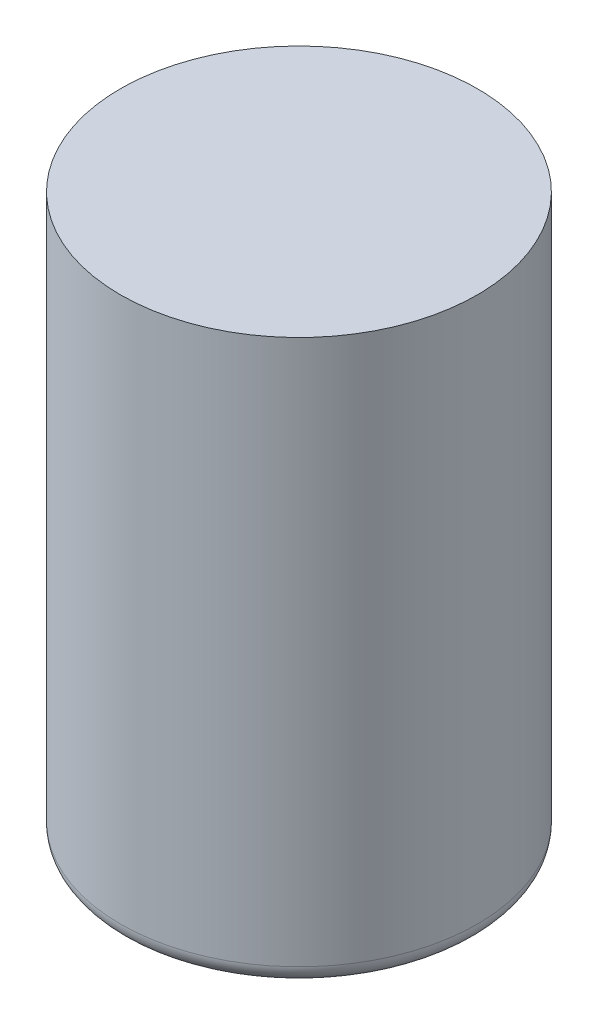
ISO-10303-21;
HEADER;
FILE_DESCRIPTION(('STEP AP214'),'2;1');
FILE_NAME('part.step','',(''),(''),'','','');
FILE_SCHEMA(('AUTOMOTIVE_DESIGN { 1 0 10303 214 1 1 1 1 }'));
ENDSEC;
DATA;
#1=APPLICATION_CONTEXT('core data for automotive mechanical design processes');
#2=APPLICATION_PROTOCOL_DEFINITION('international standard','automotive_design',2000,#1);
#3=PRODUCT_CONTEXT('',#1,'mechanical');
#4=PRODUCT('Part','Part','',(#3));
#5=PRODUCT_RELATED_PRODUCT_CATEGORY('part','',(#4));
#6=PRODUCT_DEFINITION_FORMATION('','',#4);
#7=PRODUCT_DEFINITION_CONTEXT('part definition',#1,'design');
#8=PRODUCT_DEFINITION('design','',#6,#7);
#9=PRODUCT_DEFINITION_SHAPE('','',#8);
#10=(LENGTH_UNIT() NAMED_UNIT(*) SI_UNIT(.MILLI.,.METRE.));
#11=(NAMED_UNIT(*) PLANE_ANGLE_UNIT() SI_UNIT($,.RADIAN.));
#12=(NAMED_UNIT(*) SI_UNIT($,.STERADIAN.) SOLID_ANGLE_UNIT());
#13=UNCERTAINTY_MEASURE_WITH_UNIT(LENGTH_MEASURE(1.E-05),#10,'distance_accuracy_value','');
#14=(GEOMETRIC_REPRESENTATION_CONTEXT(3) GLOBAL_UNCERTAINTY_ASSIGNED_CONTEXT((#13)) GLOBAL_UNIT_ASSIGNED_CONTEXT((#10,
#11,#12)) REPRESENTATION_CONTEXT('',''));
#15=CARTESIAN_POINT('',(0.,0.,0.));
#16=DIRECTION('',(0.,0.,1.));
#17=DIRECTION('',(1.,0.,0.));
#18=AXIS2_PLACEMENT_3D('',#15,#16,#17);
#19=CARTESIAN_POINT('',(0.,300.,0.));
#20=DIRECTION('',(0.,-1.,0.));
#21=DIRECTION('',(0.,0.,-1.));
#22=AXIS2_PLACEMENT_3D('',#19,#20,#21);
#23=CYLINDRICAL_SURFACE('',#22,95.);
#24=CARTESIAN_POINT('',(0.,10.,0.));
#25=DIRECTION('',(0.,1.,0.));
#26=DIRECTION('',(0.,0.,1.));
#27=AXIS2_PLACEMENT_3D('',#24,#25,#26);
#28=CIRCLE('',#27,95.);
#29=CARTESIAN_POINT('',(0.,10.,95.));
#30=VERTEX_POINT('',#29);
#31=EDGE_CURVE('E41',#30,#30,#28,.T.);
#32=ORIENTED_EDGE('',*,*,#31,.T.);
#33=EDGE_LOOP('',(#32));
#34=FACE_BOUND('',#33,.T.);
#35=CARTESIAN_POINT('',(0.,300.,0.));
#36=DIRECTION('',(0.,1.,0.));
#37=DIRECTION('',(0.,0.,1.));
#38=AXIS2_PLACEMENT_3D('',#35,#36,#37);
#39=CIRCLE('',#38,95.);
#40=CARTESIAN_POINT('',(0.,300.,95.));
#41=VERTEX_POINT('',#40);
#42=EDGE_CURVE('E45',#41,#41,#39,.T.);
#43=ORIENTED_EDGE('',*,*,#42,.F.);
#44=EDGE_LOOP('',(#43));
#45=FACE_BOUND('',#44,.T.);
#46=ADVANCED_FACE('F34',(#34,#45),#23,.T.);
#47=CARTESIAN_POINT('',(0.,300.,0.));
#48=DIRECTION('',(0.,1.,0.));
#49=DIRECTION('',(0.,0.,1.));
#50=AXIS2_PLACEMENT_3D('',#47,#48,#49);
#51=PLANE('',#50);
#52=ORIENTED_EDGE('',*,*,#42,.T.);
#53=EDGE_LOOP('',(#52));
#54=FACE_BOUND('',#53,.T.);
#55=ADVANCED_FACE('F52',(#54),#51,.T.);
#56=CARTESIAN_POINT('',(0.,0.,0.));
#57=DIRECTION('',(0.,1.,0.));
#58=DIRECTION('',(0.,0.,1.));
#59=AXIS2_PLACEMENT_3D('',#56,#57,#58);
#60=PLANE('',#59);
#61=CARTESIAN_POINT('',(0.,0.,0.));
#62=DIRECTION('',(0.,1.,0.));
#63=DIRECTION('',(0.,0.,1.));
#64=AXIS2_PLACEMENT_3D('',#61,#62,#63);
#65=CIRCLE('',#64,85.);
#66=CARTESIAN_POINT('',(0.,0.,85.));
#67=VERTEX_POINT('',#66);
#68=EDGE_CURVE('E10',#67,#67,#65,.F.);
#69=ORIENTED_EDGE('',*,*,#68,.T.);
#70=EDGE_LOOP('',(#69));
#71=FACE_BOUND('',#70,.T.);
#72=ADVANCED_FACE('F58',(#71),#60,.F.);
#73=CARTESIAN_POINT('',(0.,10.,0.));
#74=DIRECTION('',(0.,1.,0.));
#75=DIRECTION('',(0.,0.,1.));
#76=AXIS2_PLACEMENT_3D('',#73,#74,#75);
#77=TOROIDAL_SURFACE('',#76,85.,10.);
#78=ORIENTED_EDGE('',*,*,#68,.F.);
#79=EDGE_LOOP('',(#78));
#80=FACE_BOUND('',#79,.T.);
#81=ORIENTED_EDGE('',*,*,#31,.F.);
#82=EDGE_LOOP('',(#81));
#83=FACE_BOUND('',#82,.T.);
#84=ADVANCED_FACE('F36',(#80,#83),#77,.T.);
#85=CLOSED_SHELL('',(#46,#55,#72,#84));
#86=MANIFOLD_SOLID_BREP('B2',#85);
#87=ADVANCED_BREP_SHAPE_REPRESENTATION('',(#18,#86),#14);
#88=SHAPE_DEFINITION_REPRESENTATION(#9,#87);
ENDSEC;
END-ISO-10303-21;
